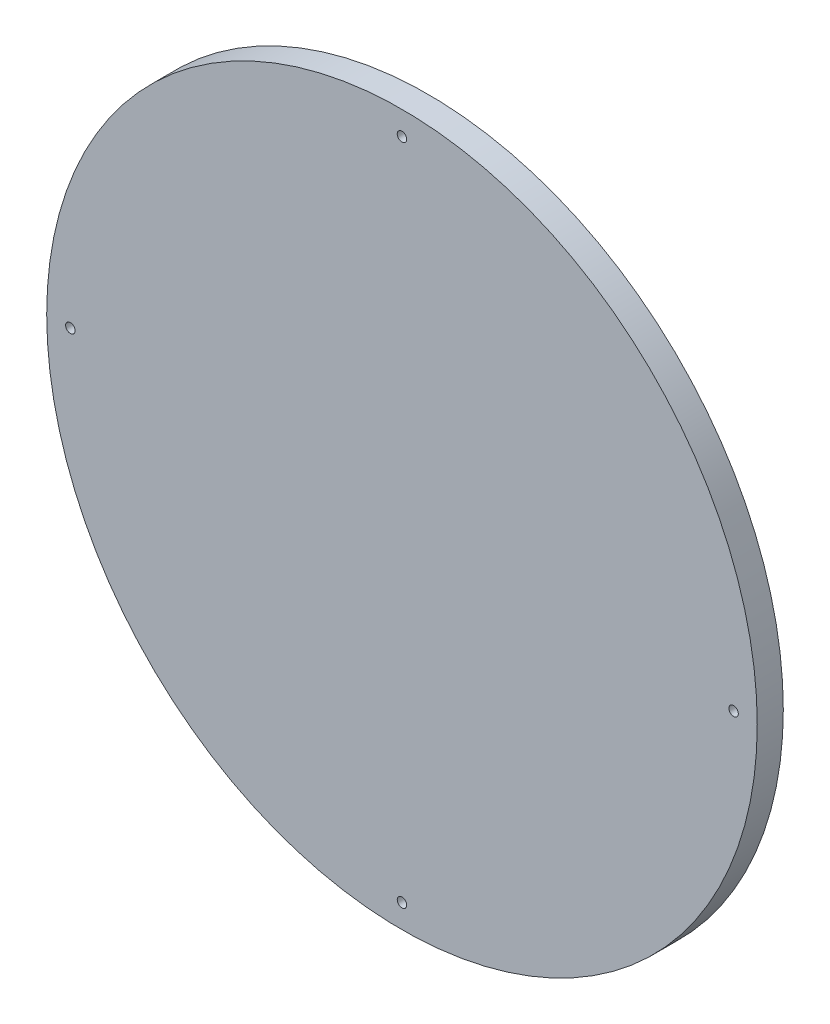
ISO-10303-21;
HEADER;
FILE_DESCRIPTION(('STEP AP214'),'2;1');
FILE_NAME('part.step','',(''),(''),'','','');
FILE_SCHEMA(('AUTOMOTIVE_DESIGN { 1 0 10303 214 1 1 1 1 }'));
ENDSEC;
DATA;
#1=APPLICATION_CONTEXT('core data for automotive mechanical design processes');
#2=APPLICATION_PROTOCOL_DEFINITION('international standard','automotive_design',2000,#1);
#3=PRODUCT_CONTEXT('',#1,'mechanical');
#4=PRODUCT('Part','Part','',(#3));
#5=PRODUCT_RELATED_PRODUCT_CATEGORY('part','',(#4));
#6=PRODUCT_DEFINITION_FORMATION('','',#4);
#7=PRODUCT_DEFINITION_CONTEXT('part definition',#1,'design');
#8=PRODUCT_DEFINITION('design','',#6,#7);
#9=PRODUCT_DEFINITION_SHAPE('','',#8);
#10=(LENGTH_UNIT() NAMED_UNIT(*) SI_UNIT(.MILLI.,.METRE.));
#11=(NAMED_UNIT(*) PLANE_ANGLE_UNIT() SI_UNIT($,.RADIAN.));
#12=(NAMED_UNIT(*) SI_UNIT($,.STERADIAN.) SOLID_ANGLE_UNIT());
#13=UNCERTAINTY_MEASURE_WITH_UNIT(LENGTH_MEASURE(1.E-05),#10,'distance_accuracy_value','');
#14=(GEOMETRIC_REPRESENTATION_CONTEXT(3) GLOBAL_UNCERTAINTY_ASSIGNED_CONTEXT((#13)) GLOBAL_UNIT_ASSIGNED_CONTEXT((#10,
#11,#12)) REPRESENTATION_CONTEXT('',''));
#15=CARTESIAN_POINT('',(0.,0.,0.));
#16=DIRECTION('',(0.,0.,1.));
#17=DIRECTION('',(1.,0.,0.));
#18=AXIS2_PLACEMENT_3D('',#15,#16,#17);
#19=CARTESIAN_POINT('',(0.,280.,0.));
#20=DIRECTION('',(0.,0.,1.));
#21=DIRECTION('',(1.,0.,0.));
#22=AXIS2_PLACEMENT_3D('',#19,#20,#21);
#23=CYLINDRICAL_SURFACE('',#22,4.);
#24=CARTESIAN_POINT('',(0.,280.,22.));
#25=DIRECTION('',(0.,0.,1.));
#26=DIRECTION('',(1.,0.,0.));
#27=AXIS2_PLACEMENT_3D('',#24,#25,#26);
#28=CIRCLE('',#27,4.);
#29=CARTESIAN_POINT('',(4.,280.,22.));
#30=VERTEX_POINT('',#29);
#31=EDGE_CURVE('E44',#30,#30,#28,.T.);
#32=ORIENTED_EDGE('',*,*,#31,.T.);
#33=EDGE_LOOP('',(#32));
#34=FACE_BOUND('',#33,.T.);
#35=CARTESIAN_POINT('',(0.,280.,5.));
#36=DIRECTION('',(0.,0.,-1.));
#37=DIRECTION('',(-1.,0.,0.));
#38=AXIS2_PLACEMENT_3D('',#35,#36,#37);
#39=CIRCLE('',#38,4.);
#40=CARTESIAN_POINT('',(-4.,280.,5.));
#41=VERTEX_POINT('',#40);
#42=EDGE_CURVE('E35',#41,#41,#39,.F.);
#43=ORIENTED_EDGE('',*,*,#42,.F.);
#44=EDGE_LOOP('',(#43));
#45=FACE_BOUND('',#44,.T.);
#46=ADVANCED_FACE('F31',(#34,#45),#23,.F.);
#47=CARTESIAN_POINT('',(0.,0.,22.));
#48=DIRECTION('',(0.,0.,-1.));
#49=DIRECTION('',(-1.,0.,0.));
#50=AXIS2_PLACEMENT_3D('',#47,#48,#49);
#51=CYLINDRICAL_SURFACE('',#50,300.);
#52=CARTESIAN_POINT('',(0.,0.,22.));
#53=DIRECTION('',(0.,0.,1.));
#54=DIRECTION('',(1.,0.,0.));
#55=AXIS2_PLACEMENT_3D('',#52,#53,#54);
#56=CIRCLE('',#55,300.);
#57=CARTESIAN_POINT('',(300.,0.,22.));
#58=VERTEX_POINT('',#57);
#59=EDGE_CURVE('E10',#58,#58,#56,.T.);
#60=ORIENTED_EDGE('',*,*,#59,.F.);
#61=EDGE_LOOP('',(#60));
#62=FACE_BOUND('',#61,.T.);
#63=CARTESIAN_POINT('',(0.,0.,0.));
#64=DIRECTION('',(0.,0.,1.));
#65=DIRECTION('',(1.,0.,0.));
#66=AXIS2_PLACEMENT_3D('',#63,#64,#65);
#67=CIRCLE('',#66,300.);
#68=CARTESIAN_POINT('',(300.,0.,0.));
#69=VERTEX_POINT('',#68);
#70=EDGE_CURVE('E39',#69,#69,#67,.T.);
#71=ORIENTED_EDGE('',*,*,#70,.T.);
#72=EDGE_LOOP('',(#71));
#73=FACE_BOUND('',#72,.T.);
#74=ADVANCED_FACE('F33',(#62,#73),#51,.T.);
#75=CARTESIAN_POINT('',(0.,0.,22.));
#76=DIRECTION('',(0.,0.,1.));
#77=DIRECTION('',(1.,0.,0.));
#78=AXIS2_PLACEMENT_3D('',#75,#76,#77);
#79=PLANE('',#78);
#80=CARTESIAN_POINT('',(280.,2.93284432462823E-12,22.));
#81=DIRECTION('',(0.,0.,1.));
#82=DIRECTION('',(0.,-1.,0.));
#83=AXIS2_PLACEMENT_3D('',#80,#81,#82);
#84=CIRCLE('',#83,4.);
#85=CARTESIAN_POINT('',(280.,-3.99999999999707,22.));
#86=VERTEX_POINT('',#85);
#87=EDGE_CURVE('E61',#86,#86,#84,.T.);
#88=ORIENTED_EDGE('',*,*,#87,.F.);
#89=EDGE_LOOP('',(#88));
#90=FACE_BOUND('',#89,.T.);
#91=CARTESIAN_POINT('',(0.,-280.,22.));
#92=DIRECTION('',(0.,0.,1.));
#93=DIRECTION('',(-1.,0.,0.));
#94=AXIS2_PLACEMENT_3D('',#91,#92,#93);
#95=CIRCLE('',#94,4.);
#96=CARTESIAN_POINT('',(-4.,-280.,22.));
#97=VERTEX_POINT('',#96);
#98=EDGE_CURVE('E55',#97,#97,#95,.T.);
#99=ORIENTED_EDGE('',*,*,#98,.F.);
#100=EDGE_LOOP('',(#99));
#101=FACE_BOUND('',#100,.T.);
#102=CARTESIAN_POINT('',(-280.,-9.77614774876077E-13,22.));
#103=DIRECTION('',(0.,0.,1.));
#104=DIRECTION('',(0.,1.,0.));
#105=AXIS2_PLACEMENT_3D('',#102,#103,#104);
#106=CIRCLE('',#105,4.);
#107=CARTESIAN_POINT('',(-280.,3.99999999999902,22.));
#108=VERTEX_POINT('',#107);
#109=EDGE_CURVE('E49',#108,#108,#106,.T.);
#110=ORIENTED_EDGE('',*,*,#109,.F.);
#111=EDGE_LOOP('',(#110));
#112=FACE_BOUND('',#111,.T.);
#113=ORIENTED_EDGE('',*,*,#31,.F.);
#114=EDGE_LOOP('',(#113));
#115=FACE_BOUND('',#114,.T.);
#116=ORIENTED_EDGE('',*,*,#59,.T.);
#117=EDGE_LOOP('',(#116));
#118=FACE_BOUND('',#117,.T.);
#119=ADVANCED_FACE('F86',(#90,#101,#112,#115,#118),#79,.T.);
#120=CARTESIAN_POINT('',(0.,0.,0.));
#121=DIRECTION('',(0.,0.,1.));
#122=DIRECTION('',(1.,0.,0.));
#123=AXIS2_PLACEMENT_3D('',#120,#121,#122);
#124=PLANE('',#123);
#125=CARTESIAN_POINT('',(-1.03014678613872E-12,280.,0.));
#126=DIRECTION('',(0.,0.,-1.));
#127=DIRECTION('',(-1.,0.,0.));
#128=AXIS2_PLACEMENT_3D('',#125,#126,#127);
#129=CIRCLE('',#128,12.);
#130=CARTESIAN_POINT('',(-12.000000000001,280.,0.));
#131=VERTEX_POINT('',#130);
#132=EDGE_CURVE('E66',#131,#131,#129,.T.);
#133=ORIENTED_EDGE('',*,*,#132,.F.);
#134=EDGE_LOOP('',(#133));
#135=FACE_BOUND('',#134,.T.);
#136=CARTESIAN_POINT('',(280.,2.93284432462823E-12,0.));
#137=DIRECTION('',(0.,0.,1.));
#138=DIRECTION('',(0.,-1.,0.));
#139=AXIS2_PLACEMENT_3D('',#136,#137,#138);
#140=CIRCLE('',#139,4.);
#141=CARTESIAN_POINT('',(280.,-3.99999999999707,0.));
#142=VERTEX_POINT('',#141);
#143=EDGE_CURVE('E58',#142,#142,#140,.T.);
#144=ORIENTED_EDGE('',*,*,#143,.T.);
#145=EDGE_LOOP('',(#144));
#146=FACE_BOUND('',#145,.T.);
#147=CARTESIAN_POINT('',(0.,-280.,0.));
#148=DIRECTION('',(0.,0.,1.));
#149=DIRECTION('',(-1.,0.,0.));
#150=AXIS2_PLACEMENT_3D('',#147,#148,#149);
#151=CIRCLE('',#150,4.);
#152=CARTESIAN_POINT('',(-4.,-280.,0.));
#153=VERTEX_POINT('',#152);
#154=EDGE_CURVE('E52',#153,#153,#151,.T.);
#155=ORIENTED_EDGE('',*,*,#154,.T.);
#156=EDGE_LOOP('',(#155));
#157=FACE_BOUND('',#156,.T.);
#158=CARTESIAN_POINT('',(-280.,-9.77614774876077E-13,0.));
#159=DIRECTION('',(0.,0.,1.));
#160=DIRECTION('',(0.,1.,0.));
#161=AXIS2_PLACEMENT_3D('',#158,#159,#160);
#162=CIRCLE('',#161,4.);
#163=CARTESIAN_POINT('',(-280.,3.99999999999902,0.));
#164=VERTEX_POINT('',#163);
#165=EDGE_CURVE('E48',#164,#164,#162,.T.);
#166=ORIENTED_EDGE('',*,*,#165,.T.);
#167=EDGE_LOOP('',(#166));
#168=FACE_BOUND('',#167,.T.);
#169=ORIENTED_EDGE('',*,*,#70,.F.);
#170=EDGE_LOOP('',(#169));
#171=FACE_BOUND('',#170,.T.);
#172=ADVANCED_FACE('F93',(#135,#146,#157,#168,#171),#124,.F.);
#173=CARTESIAN_POINT('',(-280.,-9.77614774876077E-13,0.));
#174=DIRECTION('',(0.,0.,1.));
#175=DIRECTION('',(1.,0.,0.));
#176=AXIS2_PLACEMENT_3D('',#173,#174,#175);
#177=CYLINDRICAL_SURFACE('',#176,4.);
#178=ORIENTED_EDGE('',*,*,#165,.F.);
#179=EDGE_LOOP('',(#178));
#180=FACE_BOUND('',#179,.T.);
#181=ORIENTED_EDGE('',*,*,#109,.T.);
#182=EDGE_LOOP('',(#181));
#183=FACE_BOUND('',#182,.T.);
#184=ADVANCED_FACE('F90',(#180,#183),#177,.F.);
#185=CARTESIAN_POINT('',(0.,-280.,0.));
#186=DIRECTION('',(0.,0.,1.));
#187=DIRECTION('',(1.,0.,0.));
#188=AXIS2_PLACEMENT_3D('',#185,#186,#187);
#189=CYLINDRICAL_SURFACE('',#188,4.);
#190=ORIENTED_EDGE('',*,*,#154,.F.);
#191=EDGE_LOOP('',(#190));
#192=FACE_BOUND('',#191,.T.);
#193=ORIENTED_EDGE('',*,*,#98,.T.);
#194=EDGE_LOOP('',(#193));
#195=FACE_BOUND('',#194,.T.);
#196=ADVANCED_FACE('F100',(#192,#195),#189,.F.);
#197=CARTESIAN_POINT('',(280.,2.93284432462823E-12,0.));
#198=DIRECTION('',(0.,0.,1.));
#199=DIRECTION('',(1.,0.,0.));
#200=AXIS2_PLACEMENT_3D('',#197,#198,#199);
#201=CYLINDRICAL_SURFACE('',#200,4.);
#202=ORIENTED_EDGE('',*,*,#143,.F.);
#203=EDGE_LOOP('',(#202));
#204=FACE_BOUND('',#203,.T.);
#205=ORIENTED_EDGE('',*,*,#87,.T.);
#206=EDGE_LOOP('',(#205));
#207=FACE_BOUND('',#206,.T.);
#208=ADVANCED_FACE('F120',(#204,#207),#201,.F.);
#209=CARTESIAN_POINT('',(-1.03014678613872E-12,280.,5.));
#210=DIRECTION('',(0.,0.,-1.));
#211=DIRECTION('',(-1.,0.,0.));
#212=AXIS2_PLACEMENT_3D('',#209,#210,#211);
#213=PLANE('',#212);
#214=CARTESIAN_POINT('',(-1.03014678613872E-12,280.,5.));
#215=DIRECTION('',(0.,0.,-1.));
#216=DIRECTION('',(-1.,0.,0.));
#217=AXIS2_PLACEMENT_3D('',#214,#215,#216);
#218=CIRCLE('',#217,12.);
#219=CARTESIAN_POINT('',(-12.000000000001,280.,5.));
#220=VERTEX_POINT('',#219);
#221=EDGE_CURVE('E69',#220,#220,#218,.T.);
#222=ORIENTED_EDGE('',*,*,#221,.T.);
#223=EDGE_LOOP('',(#222));
#224=FACE_BOUND('',#223,.T.);
#225=ORIENTED_EDGE('',*,*,#42,.T.);
#226=EDGE_LOOP('',(#225));
#227=FACE_BOUND('',#226,.T.);
#228=ADVANCED_FACE('F76',(#224,#227),#213,.T.);
#229=CARTESIAN_POINT('',(-1.03014678613872E-12,280.,5.));
#230=DIRECTION('',(0.,0.,-1.));
#231=DIRECTION('',(-1.,0.,0.));
#232=AXIS2_PLACEMENT_3D('',#229,#230,#231);
#233=CYLINDRICAL_SURFACE('',#232,12.);
#234=ORIENTED_EDGE('',*,*,#221,.F.);
#235=EDGE_LOOP('',(#234));
#236=FACE_BOUND('',#235,.T.);
#237=ORIENTED_EDGE('',*,*,#132,.T.);
#238=EDGE_LOOP('',(#237));
#239=FACE_BOUND('',#238,.T.);
#240=ADVANCED_FACE('F129',(#236,#239),#233,.F.);
#241=CLOSED_SHELL('',(#46,#74,#119,#172,#184,#196,#208,#228,#240));
#242=MANIFOLD_SOLID_BREP('B2',#241);
#243=ADVANCED_BREP_SHAPE_REPRESENTATION('',(#18,#242),#14);
#244=SHAPE_DEFINITION_REPRESENTATION(#9,#243);
ENDSEC;
END-ISO-10303-21;
